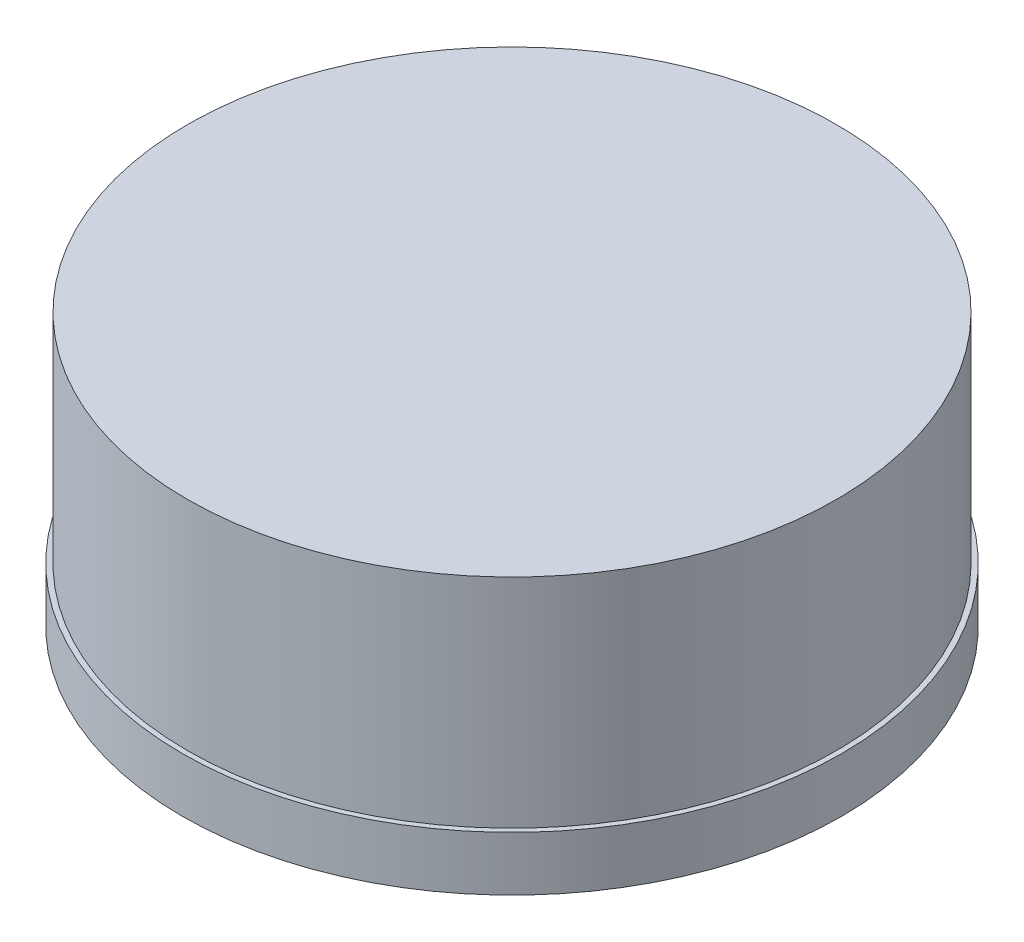
ISO-10303-21;
HEADER;
FILE_DESCRIPTION(('STEP AP214'),'2;1');
FILE_NAME('part.step','',(''),(''),'','','');
FILE_SCHEMA(('AUTOMOTIVE_DESIGN { 1 0 10303 214 1 1 1 1 }'));
ENDSEC;
DATA;
#1=APPLICATION_CONTEXT('core data for automotive mechanical design processes');
#2=APPLICATION_PROTOCOL_DEFINITION('international standard','automotive_design',2000,#1);
#3=PRODUCT_CONTEXT('',#1,'mechanical');
#4=PRODUCT('Part','Part','',(#3));
#5=PRODUCT_RELATED_PRODUCT_CATEGORY('part','',(#4));
#6=PRODUCT_DEFINITION_FORMATION('','',#4);
#7=PRODUCT_DEFINITION_CONTEXT('part definition',#1,'design');
#8=PRODUCT_DEFINITION('design','',#6,#7);
#9=PRODUCT_DEFINITION_SHAPE('','',#8);
#10=(LENGTH_UNIT() NAMED_UNIT(*) SI_UNIT(.MILLI.,.METRE.));
#11=(NAMED_UNIT(*) PLANE_ANGLE_UNIT() SI_UNIT($,.RADIAN.));
#12=(NAMED_UNIT(*) SI_UNIT($,.STERADIAN.) SOLID_ANGLE_UNIT());
#13=UNCERTAINTY_MEASURE_WITH_UNIT(LENGTH_MEASURE(1.E-05),#10,'distance_accuracy_value','');
#14=(GEOMETRIC_REPRESENTATION_CONTEXT(3) GLOBAL_UNCERTAINTY_ASSIGNED_CONTEXT((#13)) GLOBAL_UNIT_ASSIGNED_CONTEXT((#10,
#11,#12)) REPRESENTATION_CONTEXT('',''));
#15=CARTESIAN_POINT('',(0.,0.,0.));
#16=DIRECTION('',(0.,0.,1.));
#17=DIRECTION('',(1.,0.,0.));
#18=AXIS2_PLACEMENT_3D('',#15,#16,#17);
#19=CARTESIAN_POINT('',(0.,0.8,0.));
#20=DIRECTION('',(0.,-1.,0.));
#21=DIRECTION('',(0.,0.,-1.));
#22=AXIS2_PLACEMENT_3D('',#19,#20,#21);
#23=CYLINDRICAL_SURFACE('',#22,4.85);
#24=CARTESIAN_POINT('',(0.,0.8,0.));
#25=DIRECTION('',(0.,1.,0.));
#26=DIRECTION('',(0.,0.,1.));
#27=AXIS2_PLACEMENT_3D('',#24,#25,#26);
#28=CIRCLE('',#27,4.85);
#29=CARTESIAN_POINT('',(0.,0.8,4.85));
#30=VERTEX_POINT('',#29);
#31=EDGE_CURVE('E45',#30,#30,#28,.T.);
#32=ORIENTED_EDGE('',*,*,#31,.F.);
#33=EDGE_LOOP('',(#32));
#34=FACE_BOUND('',#33,.T.);
#35=CARTESIAN_POINT('',(0.,0.,0.));
#36=DIRECTION('',(0.,1.,0.));
#37=DIRECTION('',(0.,0.,1.));
#38=AXIS2_PLACEMENT_3D('',#35,#36,#37);
#39=CIRCLE('',#38,4.85);
#40=CARTESIAN_POINT('',(0.,0.,4.85));
#41=VERTEX_POINT('',#40);
#42=EDGE_CURVE('E40',#41,#41,#39,.T.);
#43=ORIENTED_EDGE('',*,*,#42,.T.);
#44=EDGE_LOOP('',(#43));
#45=FACE_BOUND('',#44,.T.);
#46=ADVANCED_FACE('F37',(#34,#45),#23,.T.);
#47=CARTESIAN_POINT('',(0.,0.8,0.));
#48=DIRECTION('',(0.,1.,0.));
#49=DIRECTION('',(0.,0.,1.));
#50=AXIS2_PLACEMENT_3D('',#47,#48,#49);
#51=PLANE('',#50);
#52=CARTESIAN_POINT('',(0.,0.8,0.));
#53=DIRECTION('',(0.,1.,0.));
#54=DIRECTION('',(0.,0.,1.));
#55=AXIS2_PLACEMENT_3D('',#52,#53,#54);
#56=CIRCLE('',#55,4.775);
#57=CARTESIAN_POINT('',(0.,0.8,4.775));
#58=VERTEX_POINT('',#57);
#59=EDGE_CURVE('E10',#58,#58,#56,.T.);
#60=ORIENTED_EDGE('',*,*,#59,.F.);
#61=EDGE_LOOP('',(#60));
#62=FACE_BOUND('',#61,.T.);
#63=ORIENTED_EDGE('',*,*,#31,.T.);
#64=EDGE_LOOP('',(#63));
#65=FACE_BOUND('',#64,.T.);
#66=ADVANCED_FACE('F78',(#62,#65),#51,.T.);
#67=CARTESIAN_POINT('',(0.,0.,0.));
#68=DIRECTION('',(0.,1.,0.));
#69=DIRECTION('',(0.,0.,1.));
#70=AXIS2_PLACEMENT_3D('',#67,#68,#69);
#71=PLANE('',#70);
#72=CARTESIAN_POINT('',(0.,0.,0.));
#73=DIRECTION('',(0.,-1.,0.));
#74=DIRECTION('',(0.,0.,-1.));
#75=AXIS2_PLACEMENT_3D('',#72,#73,#74);
#76=CIRCLE('',#75,4.05);
#77=CARTESIAN_POINT('',(0.,0.,-4.05));
#78=VERTEX_POINT('',#77);
#79=EDGE_CURVE('E57',#78,#78,#76,.T.);
#80=ORIENTED_EDGE('',*,*,#79,.F.);
#81=EDGE_LOOP('',(#80));
#82=FACE_BOUND('',#81,.T.);
#83=ORIENTED_EDGE('',*,*,#42,.F.);
#84=EDGE_LOOP('',(#83));
#85=FACE_BOUND('',#84,.T.);
#86=ADVANCED_FACE('F74',(#82,#85),#71,.F.);
#87=CARTESIAN_POINT('',(0.,4.,0.));
#88=DIRECTION('',(0.,-1.,0.));
#89=DIRECTION('',(0.,0.,-1.));
#90=AXIS2_PLACEMENT_3D('',#87,#88,#89);
#91=CYLINDRICAL_SURFACE('',#90,4.775);
#92=CARTESIAN_POINT('',(0.,4.,0.));
#93=DIRECTION('',(0.,1.,0.));
#94=DIRECTION('',(0.,0.,1.));
#95=AXIS2_PLACEMENT_3D('',#92,#93,#94);
#96=CIRCLE('',#95,4.775);
#97=CARTESIAN_POINT('',(0.,4.,4.775));
#98=VERTEX_POINT('',#97);
#99=EDGE_CURVE('E52',#98,#98,#96,.T.);
#100=ORIENTED_EDGE('',*,*,#99,.F.);
#101=EDGE_LOOP('',(#100));
#102=FACE_BOUND('',#101,.T.);
#103=ORIENTED_EDGE('',*,*,#59,.T.);
#104=EDGE_LOOP('',(#103));
#105=FACE_BOUND('',#104,.T.);
#106=ADVANCED_FACE('F77',(#102,#105),#91,.T.);
#107=CARTESIAN_POINT('',(0.,4.,0.));
#108=DIRECTION('',(0.,1.,0.));
#109=DIRECTION('',(0.,0.,1.));
#110=AXIS2_PLACEMENT_3D('',#107,#108,#109);
#111=PLANE('',#110);
#112=ORIENTED_EDGE('',*,*,#99,.T.);
#113=EDGE_LOOP('',(#112));
#114=FACE_BOUND('',#113,.T.);
#115=ADVANCED_FACE('F70',(#114),#111,.T.);
#116=CARTESIAN_POINT('',(0.,3.2,0.));
#117=DIRECTION('',(0.,-1.,0.));
#118=DIRECTION('',(0.,0.,-1.));
#119=AXIS2_PLACEMENT_3D('',#116,#117,#118);
#120=CYLINDRICAL_SURFACE('',#119,4.05);
#121=CARTESIAN_POINT('',(0.,3.2,0.));
#122=DIRECTION('',(0.,-1.,0.));
#123=DIRECTION('',(0.,0.,-1.));
#124=AXIS2_PLACEMENT_3D('',#121,#122,#123);
#125=CIRCLE('',#124,4.05);
#126=CARTESIAN_POINT('',(0.,3.2,-4.05));
#127=VERTEX_POINT('',#126);
#128=EDGE_CURVE('E56',#127,#127,#125,.T.);
#129=ORIENTED_EDGE('',*,*,#128,.F.);
#130=EDGE_LOOP('',(#129));
#131=FACE_BOUND('',#130,.T.);
#132=ORIENTED_EDGE('',*,*,#79,.T.);
#133=EDGE_LOOP('',(#132));
#134=FACE_BOUND('',#133,.T.);
#135=ADVANCED_FACE('F67',(#131,#134),#120,.F.);
#136=CARTESIAN_POINT('',(0.,3.2,0.));
#137=DIRECTION('',(0.,-1.,0.));
#138=DIRECTION('',(0.,0.,-1.));
#139=AXIS2_PLACEMENT_3D('',#136,#137,#138);
#140=PLANE('',#139);
#141=ORIENTED_EDGE('',*,*,#128,.T.);
#142=EDGE_LOOP('',(#141));
#143=FACE_BOUND('',#142,.T.);
#144=ADVANCED_FACE('F65',(#143),#140,.T.);
#145=CLOSED_SHELL('',(#46,#66,#86,#106,#115,#135,#144));
#146=MANIFOLD_SOLID_BREP('B2',#145);
#147=ADVANCED_BREP_SHAPE_REPRESENTATION('',(#18,#146),#14);
#148=SHAPE_DEFINITION_REPRESENTATION(#9,#147);
ENDSEC;
END-ISO-10303-21;
